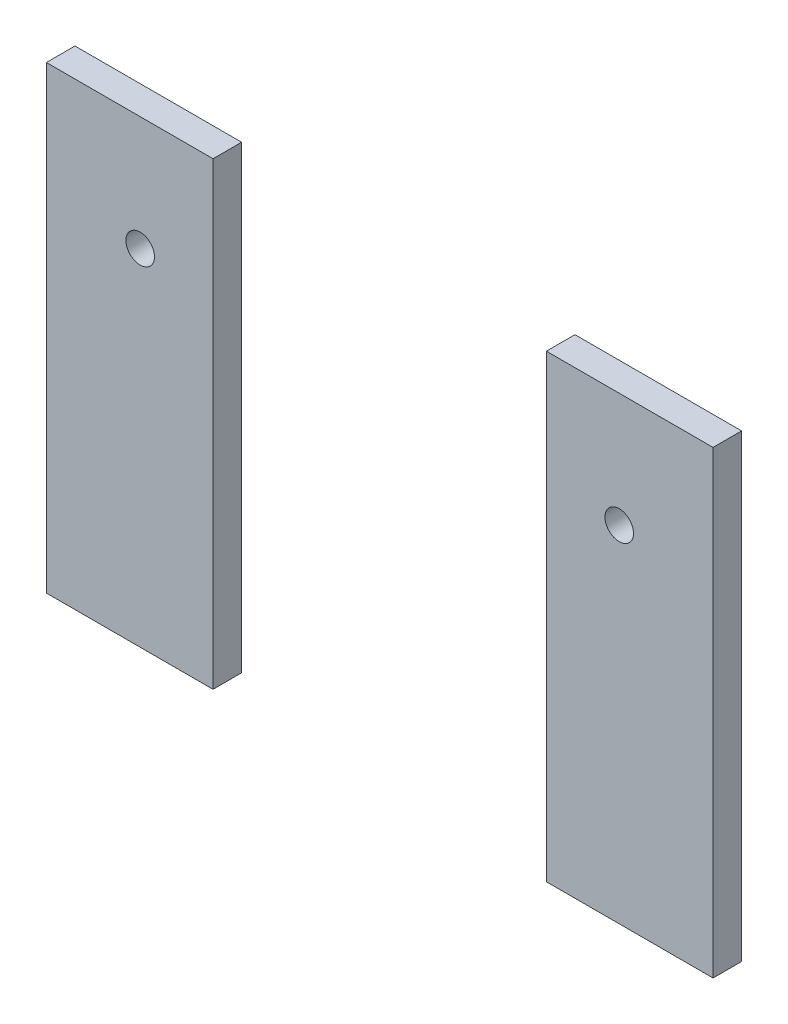
ISO-10303-21;
HEADER;
FILE_DESCRIPTION(('STEP AP214'),'2;1');
FILE_NAME('part.step','',(''),(''),'','','');
FILE_SCHEMA(('AUTOMOTIVE_DESIGN { 1 0 10303 214 1 1 1 1 }'));
ENDSEC;
DATA;
#1=APPLICATION_CONTEXT('core data for automotive mechanical design processes');
#2=APPLICATION_PROTOCOL_DEFINITION('international standard','automotive_design',2000,#1);
#3=PRODUCT_CONTEXT('',#1,'mechanical');
#4=PRODUCT('Part','Part','',(#3));
#5=PRODUCT_RELATED_PRODUCT_CATEGORY('part','',(#4));
#6=PRODUCT_DEFINITION_FORMATION('','',#4);
#7=PRODUCT_DEFINITION_CONTEXT('part definition',#1,'design');
#8=PRODUCT_DEFINITION('design','',#6,#7);
#9=PRODUCT_DEFINITION_SHAPE('','',#8);
#10=(LENGTH_UNIT() NAMED_UNIT(*) SI_UNIT(.MILLI.,.METRE.));
#11=(NAMED_UNIT(*) PLANE_ANGLE_UNIT() SI_UNIT($,.RADIAN.));
#12=(NAMED_UNIT(*) SI_UNIT($,.STERADIAN.) SOLID_ANGLE_UNIT());
#13=UNCERTAINTY_MEASURE_WITH_UNIT(LENGTH_MEASURE(1.E-05),#10,'distance_accuracy_value','');
#14=(GEOMETRIC_REPRESENTATION_CONTEXT(3) GLOBAL_UNCERTAINTY_ASSIGNED_CONTEXT((#13)) GLOBAL_UNIT_ASSIGNED_CONTEXT((#10,
#11,#12)) REPRESENTATION_CONTEXT('',''));
#15=CARTESIAN_POINT('',(0.,0.,0.));
#16=DIRECTION('',(0.,0.,1.));
#17=DIRECTION('',(1.,0.,0.));
#18=AXIS2_PLACEMENT_3D('',#15,#16,#17);
#19=CARTESIAN_POINT('',(70.,-102.5,6.));
#20=DIRECTION('',(0.,1.,0.));
#21=DIRECTION('',(0.,0.,1.));
#22=AXIS2_PLACEMENT_3D('',#19,#20,#21);
#23=PLANE('',#22);
#24=DIRECTION('',(1.,0.,0.));
#25=VECTOR('',#24,1.);
#26=CARTESIAN_POINT('',(70.,-102.5,0.));
#27=LINE('',#26,#25);
#28=CARTESIAN_POINT('',(-70.,-102.5,0.));
#29=VERTEX_POINT('',#28);
#30=CARTESIAN_POINT('',(-35.,-102.5,0.));
#31=VERTEX_POINT('',#30);
#32=EDGE_CURVE('E98',#29,#31,#27,.T.);
#33=ORIENTED_EDGE('',*,*,#32,.T.);
#34=DIRECTION('',(0.,0.,1.));
#35=VECTOR('',#34,1.);
#36=CARTESIAN_POINT('',(-35.,-102.5,6.));
#37=LINE('',#36,#35);
#38=CARTESIAN_POINT('',(-35.,-102.5,6.));
#39=VERTEX_POINT('',#38);
#40=EDGE_CURVE('E112',#31,#39,#37,.T.);
#41=ORIENTED_EDGE('',*,*,#40,.T.);
#42=DIRECTION('',(1.,0.,0.));
#43=VECTOR('',#42,1.);
#44=CARTESIAN_POINT('',(70.,-102.5,6.));
#45=LINE('',#44,#43);
#46=CARTESIAN_POINT('',(-70.,-102.5,6.));
#47=VERTEX_POINT('',#46);
#48=EDGE_CURVE('E108',#47,#39,#45,.T.);
#49=ORIENTED_EDGE('',*,*,#48,.F.);
#50=DIRECTION('',(0.,0.,-1.));
#51=VECTOR('',#50,1.);
#52=CARTESIAN_POINT('',(-70.,-102.5,6.));
#53=LINE('',#52,#51);
#54=EDGE_CURVE('E107',#47,#29,#53,.T.);
#55=ORIENTED_EDGE('',*,*,#54,.T.);
#56=EDGE_LOOP('',(#33,#41,#49,#55));
#57=FACE_BOUND('',#56,.T.);
#58=ADVANCED_FACE('F49',(#57),#23,.F.);
#59=CARTESIAN_POINT('',(0.,0.,6.));
#60=DIRECTION('',(0.,0.,1.));
#61=DIRECTION('',(1.,0.,0.));
#62=AXIS2_PLACEMENT_3D('',#59,#60,#61);
#63=PLANE('',#62);
#64=DIRECTION('',(1.,0.,0.));
#65=VECTOR('',#64,1.);
#66=CARTESIAN_POINT('',(-84.7170551939485,-6.,6.));
#67=LINE('',#66,#65);
#68=CARTESIAN_POINT('',(-70.,-6.,6.));
#69=VERTEX_POINT('',#68);
#70=CARTESIAN_POINT('',(-35.,-6.00000000000001,6.));
#71=VERTEX_POINT('',#70);
#72=EDGE_CURVE('E63',#69,#71,#67,.T.);
#73=ORIENTED_EDGE('',*,*,#72,.F.);
#74=DIRECTION('',(0.,-1.,0.));
#75=VECTOR('',#74,1.);
#76=CARTESIAN_POINT('',(-70.,-102.5,6.));
#77=LINE('',#76,#75);
#78=EDGE_CURVE('E86',#69,#47,#77,.T.);
#79=ORIENTED_EDGE('',*,*,#78,.T.);
#80=ORIENTED_EDGE('',*,*,#48,.T.);
#81=DIRECTION('',(0.,-1.,0.));
#82=VECTOR('',#81,1.);
#83=CARTESIAN_POINT('',(-35.,-117.2121885735,6.));
#84=LINE('',#83,#82);
#85=EDGE_CURVE('E56',#71,#39,#84,.T.);
#86=ORIENTED_EDGE('',*,*,#85,.F.);
#87=EDGE_LOOP('',(#73,#79,#80,#86));
#88=FACE_BOUND('',#87,.T.);
#89=CARTESIAN_POINT('',(-50.3,-30.,6.));
#90=DIRECTION('',(0.,0.,1.));
#91=DIRECTION('',(1.,0.,0.));
#92=AXIS2_PLACEMENT_3D('',#89,#90,#91);
#93=CIRCLE('',#92,3.);
#94=CARTESIAN_POINT('',(-47.3,-30.,6.));
#95=VERTEX_POINT('',#94);
#96=EDGE_CURVE('E115',#95,#95,#93,.T.);
#97=ORIENTED_EDGE('',*,*,#96,.F.);
#98=EDGE_LOOP('',(#97));
#99=FACE_BOUND('',#98,.T.);
#100=ADVANCED_FACE('F101',(#88,#99),#63,.T.);
#101=CARTESIAN_POINT('',(0.,0.,0.));
#102=DIRECTION('',(0.,0.,1.));
#103=DIRECTION('',(1.,0.,0.));
#104=AXIS2_PLACEMENT_3D('',#101,#102,#103);
#105=PLANE('',#104);
#106=CARTESIAN_POINT('',(-50.3,-30.,0.));
#107=DIRECTION('',(0.,0.,1.));
#108=DIRECTION('',(1.,0.,0.));
#109=AXIS2_PLACEMENT_3D('',#106,#107,#108);
#110=CIRCLE('',#109,3.);
#111=CARTESIAN_POINT('',(-47.3,-30.,0.));
#112=VERTEX_POINT('',#111);
#113=EDGE_CURVE('E110',#112,#112,#110,.T.);
#114=ORIENTED_EDGE('',*,*,#113,.T.);
#115=EDGE_LOOP('',(#114));
#116=FACE_BOUND('',#115,.T.);
#117=DIRECTION('',(0.,-1.,0.));
#118=VECTOR('',#117,1.);
#119=CARTESIAN_POINT('',(-70.,-102.5,0.));
#120=LINE('',#119,#118);
#121=CARTESIAN_POINT('',(-70.,-6.,0.));
#122=VERTEX_POINT('',#121);
#123=EDGE_CURVE('E117',#122,#29,#120,.T.);
#124=ORIENTED_EDGE('',*,*,#123,.F.);
#125=DIRECTION('',(1.,0.,0.));
#126=VECTOR('',#125,1.);
#127=CARTESIAN_POINT('',(0.,-6.,0.));
#128=LINE('',#127,#126);
#129=CARTESIAN_POINT('',(-35.,-6.00000000000001,0.));
#130=VERTEX_POINT('',#129);
#131=EDGE_CURVE('E90',#122,#130,#128,.T.);
#132=ORIENTED_EDGE('',*,*,#131,.T.);
#133=DIRECTION('',(0.,-1.,0.));
#134=VECTOR('',#133,1.);
#135=CARTESIAN_POINT('',(-35.,0.,0.));
#136=LINE('',#135,#134);
#137=EDGE_CURVE('E71',#130,#31,#136,.T.);
#138=ORIENTED_EDGE('',*,*,#137,.T.);
#139=ORIENTED_EDGE('',*,*,#32,.F.);
#140=EDGE_LOOP('',(#124,#132,#138,#139));
#141=FACE_BOUND('',#140,.T.);
#142=ADVANCED_FACE('F128',(#116,#141),#105,.F.);
#143=CARTESIAN_POINT('',(-70.,-102.5,6.));
#144=DIRECTION('',(1.,0.,0.));
#145=DIRECTION('',(0.,0.,-1.));
#146=AXIS2_PLACEMENT_3D('',#143,#144,#145);
#147=PLANE('',#146);
#148=ORIENTED_EDGE('',*,*,#78,.F.);
#149=DIRECTION('',(0.,0.,-1.));
#150=VECTOR('',#149,1.);
#151=CARTESIAN_POINT('',(-70.,-6.00000000000001,6.));
#152=LINE('',#151,#150);
#153=EDGE_CURVE('E94',#69,#122,#152,.T.);
#154=ORIENTED_EDGE('',*,*,#153,.T.);
#155=ORIENTED_EDGE('',*,*,#123,.T.);
#156=ORIENTED_EDGE('',*,*,#54,.F.);
#157=EDGE_LOOP('',(#148,#154,#155,#156));
#158=FACE_BOUND('',#157,.T.);
#159=ADVANCED_FACE('F105',(#158),#147,.F.);
#160=CARTESIAN_POINT('',(-50.3,-30.,-4.));
#161=DIRECTION('',(0.,0.,1.));
#162=DIRECTION('',(1.,0.,0.));
#163=AXIS2_PLACEMENT_3D('',#160,#161,#162);
#164=CYLINDRICAL_SURFACE('',#163,3.);
#165=ORIENTED_EDGE('',*,*,#96,.T.);
#166=EDGE_LOOP('',(#165));
#167=FACE_BOUND('',#166,.T.);
#168=ORIENTED_EDGE('',*,*,#113,.F.);
#169=EDGE_LOOP('',(#168));
#170=FACE_BOUND('',#169,.T.);
#171=ADVANCED_FACE('F133',(#167,#170),#164,.F.);
#172=CARTESIAN_POINT('',(-35.,-117.2121885735,-4.));
#173=DIRECTION('',(-1.,0.,0.));
#174=DIRECTION('',(0.,0.,1.));
#175=AXIS2_PLACEMENT_3D('',#172,#173,#174);
#176=PLANE('',#175);
#177=ORIENTED_EDGE('',*,*,#137,.F.);
#178=DIRECTION('',(0.,0.,1.));
#179=VECTOR('',#178,1.);
#180=CARTESIAN_POINT('',(-35.,-6.00000000000001,-4.));
#181=LINE('',#180,#179);
#182=EDGE_CURVE('E12',#130,#71,#181,.T.);
#183=ORIENTED_EDGE('',*,*,#182,.T.);
#184=ORIENTED_EDGE('',*,*,#85,.T.);
#185=ORIENTED_EDGE('',*,*,#40,.F.);
#186=EDGE_LOOP('',(#177,#183,#184,#185));
#187=FACE_BOUND('',#186,.T.);
#188=ADVANCED_FACE('F131',(#187),#176,.F.);
#189=CARTESIAN_POINT('',(-84.7170551939485,-6.,-4.));
#190=DIRECTION('',(0.,-1.,0.));
#191=DIRECTION('',(0.,0.,-1.));
#192=AXIS2_PLACEMENT_3D('',#189,#190,#191);
#193=PLANE('',#192);
#194=ORIENTED_EDGE('',*,*,#72,.T.);
#195=ORIENTED_EDGE('',*,*,#182,.F.);
#196=ORIENTED_EDGE('',*,*,#131,.F.);
#197=ORIENTED_EDGE('',*,*,#153,.F.);
#198=EDGE_LOOP('',(#194,#195,#196,#197));
#199=FACE_BOUND('',#198,.T.);
#200=ADVANCED_FACE('F95',(#199),#193,.F.);
#201=CLOSED_SHELL('',(#58,#100,#142,#159,#171,#188,#200));
#202=MANIFOLD_SOLID_BREP('B2',#201);
#203=CARTESIAN_POINT('',(70.,-102.5,6.));
#204=DIRECTION('',(-1.,0.,0.));
#205=DIRECTION('',(0.,0.,1.));
#206=AXIS2_PLACEMENT_3D('',#203,#204,#205);
#207=PLANE('',#206);
#208=DIRECTION('',(0.,1.,0.));
#209=VECTOR('',#208,1.);
#210=CARTESIAN_POINT('',(70.,-102.5,0.));
#211=LINE('',#210,#209);
#212=CARTESIAN_POINT('',(70.,-102.5,0.));
#213=VERTEX_POINT('',#212);
#214=CARTESIAN_POINT('',(70.,-6.,0.));
#215=VERTEX_POINT('',#214);
#216=EDGE_CURVE('E297',#213,#215,#211,.T.);
#217=ORIENTED_EDGE('',*,*,#216,.T.);
#218=DIRECTION('',(0.,0.,1.));
#219=VECTOR('',#218,1.);
#220=CARTESIAN_POINT('',(70.,-6.00000000000001,6.));
#221=LINE('',#220,#219);
#222=CARTESIAN_POINT('',(70.,-6.,6.));
#223=VERTEX_POINT('',#222);
#224=EDGE_CURVE('E253',#215,#223,#221,.T.);
#225=ORIENTED_EDGE('',*,*,#224,.T.);
#226=DIRECTION('',(0.,1.,0.));
#227=VECTOR('',#226,1.);
#228=CARTESIAN_POINT('',(70.,-102.5,6.));
#229=LINE('',#228,#227);
#230=CARTESIAN_POINT('',(70.,-102.5,6.));
#231=VERTEX_POINT('',#230);
#232=EDGE_CURVE('E246',#231,#223,#229,.T.);
#233=ORIENTED_EDGE('',*,*,#232,.F.);
#234=DIRECTION('',(0.,0.,-1.));
#235=VECTOR('',#234,1.);
#236=CARTESIAN_POINT('',(70.,-102.5,6.));
#237=LINE('',#236,#235);
#238=EDGE_CURVE('E293',#231,#213,#237,.T.);
#239=ORIENTED_EDGE('',*,*,#238,.T.);
#240=EDGE_LOOP('',(#217,#225,#233,#239));
#241=FACE_BOUND('',#240,.T.);
#242=ADVANCED_FACE('F195',(#241),#207,.F.);
#243=CARTESIAN_POINT('',(50.3,-30.,-4.));
#244=DIRECTION('',(0.,0.,1.));
#245=DIRECTION('',(1.,0.,0.));
#246=AXIS2_PLACEMENT_3D('',#243,#244,#245);
#247=CYLINDRICAL_SURFACE('',#246,3.);
#248=CARTESIAN_POINT('',(50.3,-30.,6.));
#249=DIRECTION('',(0.,0.,1.));
#250=DIRECTION('',(1.,0.,0.));
#251=AXIS2_PLACEMENT_3D('',#248,#249,#250);
#252=CIRCLE('',#251,3.);
#253=CARTESIAN_POINT('',(53.3,-30.,6.));
#254=VERTEX_POINT('',#253);
#255=EDGE_CURVE('E257',#254,#254,#252,.T.);
#256=ORIENTED_EDGE('',*,*,#255,.T.);
#257=EDGE_LOOP('',(#256));
#258=FACE_BOUND('',#257,.T.);
#259=CARTESIAN_POINT('',(50.3,-30.,0.));
#260=DIRECTION('',(0.,0.,1.));
#261=DIRECTION('',(1.,0.,0.));
#262=AXIS2_PLACEMENT_3D('',#259,#260,#261);
#263=CIRCLE('',#262,3.);
#264=CARTESIAN_POINT('',(53.3,-30.,0.));
#265=VERTEX_POINT('',#264);
#266=EDGE_CURVE('E266',#265,#265,#263,.T.);
#267=ORIENTED_EDGE('',*,*,#266,.F.);
#268=EDGE_LOOP('',(#267));
#269=FACE_BOUND('',#268,.T.);
#270=ADVANCED_FACE('F315',(#258,#269),#247,.F.);
#271=CARTESIAN_POINT('',(0.,0.,6.));
#272=DIRECTION('',(0.,0.,1.));
#273=DIRECTION('',(1.,0.,0.));
#274=AXIS2_PLACEMENT_3D('',#271,#272,#273);
#275=PLANE('',#274);
#276=DIRECTION('',(1.,0.,0.));
#277=VECTOR('',#276,1.);
#278=CARTESIAN_POINT('',(-84.7170551939485,-6.,6.));
#279=LINE('',#278,#277);
#280=CARTESIAN_POINT('',(35.,-6.,6.));
#281=VERTEX_POINT('',#280);
#282=EDGE_CURVE('E237',#281,#223,#279,.T.);
#283=ORIENTED_EDGE('',*,*,#282,.F.);
#284=DIRECTION('',(0.,1.,0.));
#285=VECTOR('',#284,1.);
#286=CARTESIAN_POINT('',(35.,-117.2121885735,6.));
#287=LINE('',#286,#285);
#288=CARTESIAN_POINT('',(35.,-102.5,6.));
#289=VERTEX_POINT('',#288);
#290=EDGE_CURVE('E244',#289,#281,#287,.T.);
#291=ORIENTED_EDGE('',*,*,#290,.F.);
#292=DIRECTION('',(1.,0.,0.));
#293=VECTOR('',#292,1.);
#294=CARTESIAN_POINT('',(70.,-102.5,6.));
#295=LINE('',#294,#293);
#296=EDGE_CURVE('E219',#289,#231,#295,.T.);
#297=ORIENTED_EDGE('',*,*,#296,.T.);
#298=ORIENTED_EDGE('',*,*,#232,.T.);
#299=EDGE_LOOP('',(#283,#291,#297,#298));
#300=FACE_BOUND('',#299,.T.);
#301=ORIENTED_EDGE('',*,*,#255,.F.);
#302=EDGE_LOOP('',(#301));
#303=FACE_BOUND('',#302,.T.);
#304=ADVANCED_FACE('F242',(#300,#303),#275,.T.);
#305=CARTESIAN_POINT('',(0.,0.,0.));
#306=DIRECTION('',(0.,0.,1.));
#307=DIRECTION('',(1.,0.,0.));
#308=AXIS2_PLACEMENT_3D('',#305,#306,#307);
#309=PLANE('',#308);
#310=ORIENTED_EDGE('',*,*,#266,.T.);
#311=EDGE_LOOP('',(#310));
#312=FACE_BOUND('',#311,.T.);
#313=DIRECTION('',(0.,1.,0.));
#314=VECTOR('',#313,1.);
#315=CARTESIAN_POINT('',(35.,0.,0.));
#316=LINE('',#315,#314);
#317=CARTESIAN_POINT('',(35.,-102.5,0.));
#318=VERTEX_POINT('',#317);
#319=CARTESIAN_POINT('',(35.,-6.00000000000001,0.));
#320=VERTEX_POINT('',#319);
#321=EDGE_CURVE('E204',#318,#320,#316,.T.);
#322=ORIENTED_EDGE('',*,*,#321,.T.);
#323=DIRECTION('',(1.,0.,0.));
#324=VECTOR('',#323,1.);
#325=CARTESIAN_POINT('',(0.,-6.,0.));
#326=LINE('',#325,#324);
#327=EDGE_CURVE('E211',#320,#215,#326,.T.);
#328=ORIENTED_EDGE('',*,*,#327,.T.);
#329=ORIENTED_EDGE('',*,*,#216,.F.);
#330=DIRECTION('',(1.,0.,0.));
#331=VECTOR('',#330,1.);
#332=CARTESIAN_POINT('',(70.,-102.5,0.));
#333=LINE('',#332,#331);
#334=EDGE_CURVE('E294',#318,#213,#333,.T.);
#335=ORIENTED_EDGE('',*,*,#334,.F.);
#336=EDGE_LOOP('',(#322,#328,#329,#335));
#337=FACE_BOUND('',#336,.T.);
#338=ADVANCED_FACE('F309',(#312,#337),#309,.F.);
#339=CARTESIAN_POINT('',(70.,-102.5,6.));
#340=DIRECTION('',(0.,1.,0.));
#341=DIRECTION('',(0.,0.,1.));
#342=AXIS2_PLACEMENT_3D('',#339,#340,#341);
#343=PLANE('',#342);
#344=ORIENTED_EDGE('',*,*,#296,.F.);
#345=DIRECTION('',(0.,0.,-1.));
#346=VECTOR('',#345,1.);
#347=CARTESIAN_POINT('',(35.,-102.5,6.));
#348=LINE('',#347,#346);
#349=EDGE_CURVE('E251',#289,#318,#348,.T.);
#350=ORIENTED_EDGE('',*,*,#349,.T.);
#351=ORIENTED_EDGE('',*,*,#334,.T.);
#352=ORIENTED_EDGE('',*,*,#238,.F.);
#353=EDGE_LOOP('',(#344,#350,#351,#352));
#354=FACE_BOUND('',#353,.T.);
#355=ADVANCED_FACE('F197',(#354),#343,.F.);
#356=CARTESIAN_POINT('',(35.,-117.2121885735,-4.));
#357=DIRECTION('',(1.,0.,0.));
#358=DIRECTION('',(0.,0.,-1.));
#359=AXIS2_PLACEMENT_3D('',#356,#357,#358);
#360=PLANE('',#359);
#361=ORIENTED_EDGE('',*,*,#290,.T.);
#362=DIRECTION('',(0.,0.,-1.));
#363=VECTOR('',#362,1.);
#364=CARTESIAN_POINT('',(35.,-6.00000000000001,-4.));
#365=LINE('',#364,#363);
#366=EDGE_CURVE('E47',#281,#320,#365,.T.);
#367=ORIENTED_EDGE('',*,*,#366,.T.);
#368=ORIENTED_EDGE('',*,*,#321,.F.);
#369=ORIENTED_EDGE('',*,*,#349,.F.);
#370=EDGE_LOOP('',(#361,#367,#368,#369));
#371=FACE_BOUND('',#370,.T.);
#372=ADVANCED_FACE('F249',(#371),#360,.F.);
#373=CARTESIAN_POINT('',(-84.7170551939485,-6.,-4.));
#374=DIRECTION('',(0.,-1.,0.));
#375=DIRECTION('',(0.,0.,-1.));
#376=AXIS2_PLACEMENT_3D('',#373,#374,#375);
#377=PLANE('',#376);
#378=ORIENTED_EDGE('',*,*,#327,.F.);
#379=ORIENTED_EDGE('',*,*,#366,.F.);
#380=ORIENTED_EDGE('',*,*,#282,.T.);
#381=ORIENTED_EDGE('',*,*,#224,.F.);
#382=EDGE_LOOP('',(#378,#379,#380,#381));
#383=FACE_BOUND('',#382,.T.);
#384=ADVANCED_FACE('F236',(#383),#377,.F.);
#385=CLOSED_SHELL('',(#242,#270,#304,#338,#355,#372,#384));
#386=MANIFOLD_SOLID_BREP('B6',#385);
#387=ADVANCED_BREP_SHAPE_REPRESENTATION('',(#18,#202,#386),#14);
#388=SHAPE_DEFINITION_REPRESENTATION(#9,#387);
ENDSEC;
END-ISO-10303-21;
